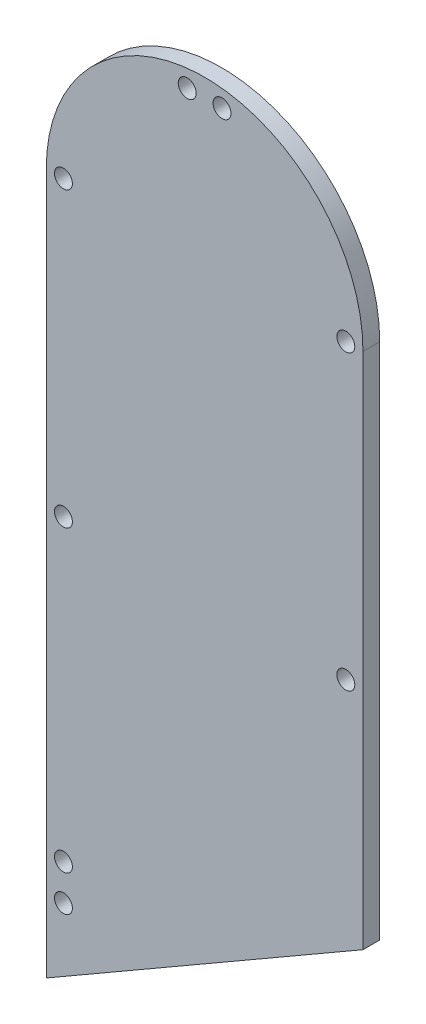
ISO-10303-21;
HEADER;
FILE_DESCRIPTION(('STEP AP214'),'2;1');
FILE_NAME('part.step','',(''),(''),'','','');
FILE_SCHEMA(('AUTOMOTIVE_DESIGN { 1 0 10303 214 1 1 1 1 }'));
ENDSEC;
DATA;
#1=APPLICATION_CONTEXT('core data for automotive mechanical design processes');
#2=APPLICATION_PROTOCOL_DEFINITION('international standard','automotive_design',2000,#1);
#3=PRODUCT_CONTEXT('',#1,'mechanical');
#4=PRODUCT('Part','Part','',(#3));
#5=PRODUCT_RELATED_PRODUCT_CATEGORY('part','',(#4));
#6=PRODUCT_DEFINITION_FORMATION('','',#4);
#7=PRODUCT_DEFINITION_CONTEXT('part definition',#1,'design');
#8=PRODUCT_DEFINITION('design','',#6,#7);
#9=PRODUCT_DEFINITION_SHAPE('','',#8);
#10=(LENGTH_UNIT() NAMED_UNIT(*) SI_UNIT(.MILLI.,.METRE.));
#11=(NAMED_UNIT(*) PLANE_ANGLE_UNIT() SI_UNIT($,.RADIAN.));
#12=(NAMED_UNIT(*) SI_UNIT($,.STERADIAN.) SOLID_ANGLE_UNIT());
#13=UNCERTAINTY_MEASURE_WITH_UNIT(LENGTH_MEASURE(1.E-05),#10,'distance_accuracy_value','');
#14=(GEOMETRIC_REPRESENTATION_CONTEXT(3) GLOBAL_UNCERTAINTY_ASSIGNED_CONTEXT((#13)) GLOBAL_UNIT_ASSIGNED_CONTEXT((#10,
#11,#12)) REPRESENTATION_CONTEXT('',''));
#15=CARTESIAN_POINT('',(0.,0.,0.));
#16=DIRECTION('',(0.,0.,1.));
#17=DIRECTION('',(1.,0.,0.));
#18=AXIS2_PLACEMENT_3D('',#15,#16,#17);
#19=CARTESIAN_POINT('',(24.5827179372451,-59.5829059297929,3.175));
#20=DIRECTION('',(0.,0.,1.));
#21=DIRECTION('',(1.,0.,0.));
#22=AXIS2_PLACEMENT_3D('',#19,#20,#21);
#23=PLANE('',#22);
#24=DIRECTION('',(-0.866025403784438,-0.500000000000001,0.));
#25=VECTOR('',#24,1.);
#26=CARTESIAN_POINT('',(-23.1785985762499,28.3308495887852,3.175));
#27=LINE('',#26,#25);
#28=CARTESIAN_POINT('',(54.5827179372451,73.2263666103914,3.175));
#29=VERTEX_POINT('',#28);
#30=CARTESIAN_POINT('',(-5.41728206275491,38.5853504590137,3.175));
#31=VERTEX_POINT('',#30);
#32=EDGE_CURVE('E47',#29,#31,#27,.T.);
#33=ORIENTED_EDGE('',*,*,#32,.F.);
#34=DIRECTION('',(0.,1.,0.));
#35=VECTOR('',#34,1.);
#36=CARTESIAN_POINT('',(54.5827179372451,-59.5829059297929,3.175));
#37=LINE('',#36,#35);
#38=CARTESIAN_POINT('',(54.5827179372451,171.394622999198,3.175));
#39=VERTEX_POINT('',#38);
#40=EDGE_CURVE('E90',#29,#39,#37,.T.);
#41=ORIENTED_EDGE('',*,*,#40,.T.);
#42=CARTESIAN_POINT('',(24.5827179372451,171.394622999198,3.175));
#43=DIRECTION('',(0.,0.,1.));
#44=DIRECTION('',(1.,0.,0.));
#45=AXIS2_PLACEMENT_3D('',#42,#43,#44);
#46=CIRCLE('',#45,30.);
#47=CARTESIAN_POINT('',(-5.41728206275491,171.394622999198,3.175));
#48=VERTEX_POINT('',#47);
#49=EDGE_CURVE('E55',#39,#48,#46,.T.);
#50=ORIENTED_EDGE('',*,*,#49,.T.);
#51=DIRECTION('',(0.,-1.,0.));
#52=VECTOR('',#51,1.);
#53=CARTESIAN_POINT('',(-5.41728206275491,171.394622999198,3.175));
#54=LINE('',#53,#52);
#55=EDGE_CURVE('E83',#48,#31,#54,.T.);
#56=ORIENTED_EDGE('',*,*,#55,.T.);
#57=EDGE_LOOP('',(#33,#41,#50,#56));
#58=FACE_BOUND('',#57,.T.);
#59=CARTESIAN_POINT('',(21.2827179372451,197.940291195723,3.175));
#60=DIRECTION('',(0.,0.,1.));
#61=DIRECTION('',(1.,0.,0.));
#62=AXIS2_PLACEMENT_3D('',#59,#60,#61);
#63=CIRCLE('',#62,1.70000000000001);
#64=CARTESIAN_POINT('',(22.9827179372451,197.940291195723,3.175));
#65=VERTEX_POINT('',#64);
#66=EDGE_CURVE('E131',#65,#65,#63,.T.);
#67=ORIENTED_EDGE('',*,*,#66,.F.);
#68=EDGE_LOOP('',(#67));
#69=FACE_BOUND('',#68,.T.);
#70=CARTESIAN_POINT('',(51.3327179372449,115.905858534703,3.175));
#71=DIRECTION('',(0.,0.,1.));
#72=DIRECTION('',(1.,0.,0.));
#73=AXIS2_PLACEMENT_3D('',#70,#71,#72);
#74=CIRCLE('',#73,1.70000000000001);
#75=CARTESIAN_POINT('',(53.0327179372449,115.905858534703,3.175));
#76=VERTEX_POINT('',#75);
#77=EDGE_CURVE('E119',#76,#76,#74,.T.);
#78=ORIENTED_EDGE('',*,*,#77,.F.);
#79=EDGE_LOOP('',(#78));
#80=FACE_BOUND('',#79,.T.);
#81=CARTESIAN_POINT('',(51.3327179372474,171.3946229992,3.175));
#82=DIRECTION('',(0.,0.,1.));
#83=DIRECTION('',(1.,0.,0.));
#84=AXIS2_PLACEMENT_3D('',#81,#82,#83);
#85=CIRCLE('',#84,1.70000000000001);
#86=CARTESIAN_POINT('',(53.0327179372474,171.3946229992,3.175));
#87=VERTEX_POINT('',#86);
#88=EDGE_CURVE('E101',#87,#87,#85,.T.);
#89=ORIENTED_EDGE('',*,*,#88,.F.);
#90=EDGE_LOOP('',(#89));
#91=FACE_BOUND('',#90,.T.);
#92=CARTESIAN_POINT('',(27.8827179372451,197.940291195723,3.175));
#93=DIRECTION('',(0.,0.,1.));
#94=DIRECTION('',(1.,0.,0.));
#95=AXIS2_PLACEMENT_3D('',#92,#93,#94);
#96=CIRCLE('',#95,1.70000000000001);
#97=CARTESIAN_POINT('',(29.5827179372451,197.940291195723,3.175));
#98=VERTEX_POINT('',#97);
#99=EDGE_CURVE('E95',#98,#98,#96,.T.);
#100=ORIENTED_EDGE('',*,*,#99,.F.);
#101=EDGE_LOOP('',(#100));
#102=FACE_BOUND('',#101,.T.);
#103=CARTESIAN_POINT('',(-2.1672820627549,59.3058585347025,3.175));
#104=DIRECTION('',(0.,0.,1.));
#105=DIRECTION('',(1.,0.,0.));
#106=AXIS2_PLACEMENT_3D('',#103,#104,#105);
#107=CIRCLE('',#106,1.70000000000001);
#108=CARTESIAN_POINT('',(-0.46728206275489,59.3058585347025,3.175));
#109=VERTEX_POINT('',#108);
#110=EDGE_CURVE('E107',#109,#109,#107,.T.);
#111=ORIENTED_EDGE('',*,*,#110,.F.);
#112=EDGE_LOOP('',(#111));
#113=FACE_BOUND('',#112,.T.);
#114=CARTESIAN_POINT('',(-2.16728206275266,171.394622999196,3.175));
#115=DIRECTION('',(0.,0.,1.));
#116=DIRECTION('',(1.,0.,0.));
#117=AXIS2_PLACEMENT_3D('',#114,#115,#116);
#118=CIRCLE('',#117,1.70000000000001);
#119=CARTESIAN_POINT('',(-0.467282062752642,171.394622999196,3.175));
#120=VERTEX_POINT('',#119);
#121=EDGE_CURVE('E113',#120,#120,#118,.T.);
#122=ORIENTED_EDGE('',*,*,#121,.F.);
#123=EDGE_LOOP('',(#122));
#124=FACE_BOUND('',#123,.T.);
#125=CARTESIAN_POINT('',(-2.16728206275513,115.905858534703,3.175));
#126=DIRECTION('',(0.,0.,1.));
#127=DIRECTION('',(1.,0.,0.));
#128=AXIS2_PLACEMENT_3D('',#125,#126,#127);
#129=CIRCLE('',#128,1.70000000000001);
#130=CARTESIAN_POINT('',(-0.467282062755112,115.905858534703,3.175));
#131=VERTEX_POINT('',#130);
#132=EDGE_CURVE('E125',#131,#131,#129,.T.);
#133=ORIENTED_EDGE('',*,*,#132,.F.);
#134=EDGE_LOOP('',(#133));
#135=FACE_BOUND('',#134,.T.);
#136=CARTESIAN_POINT('',(-2.1672820627549,52.5058585347025,3.175));
#137=DIRECTION('',(0.,0.,1.));
#138=DIRECTION('',(1.,0.,0.));
#139=AXIS2_PLACEMENT_3D('',#136,#137,#138);
#140=CIRCLE('',#139,1.70000000000001);
#141=CARTESIAN_POINT('',(-0.46728206275489,52.5058585347025,3.175));
#142=VERTEX_POINT('',#141);
#143=EDGE_CURVE('E137',#142,#142,#140,.T.);
#144=ORIENTED_EDGE('',*,*,#143,.F.);
#145=EDGE_LOOP('',(#144));
#146=FACE_BOUND('',#145,.T.);
#147=ADVANCED_FACE('F32',(#58,#69,#80,#91,#102,#113,#124,#135,#146),#23,.T.);
#148=CARTESIAN_POINT('',(24.5827179372451,-59.5829059297929,0.));
#149=DIRECTION('',(0.,0.,1.));
#150=DIRECTION('',(1.,0.,0.));
#151=AXIS2_PLACEMENT_3D('',#148,#149,#150);
#152=PLANE('',#151);
#153=DIRECTION('',(0.,1.,0.));
#154=VECTOR('',#153,1.);
#155=CARTESIAN_POINT('',(54.5827179372451,-59.5829059297929,0.));
#156=LINE('',#155,#154);
#157=CARTESIAN_POINT('',(54.5827179372451,73.2263666103914,0.));
#158=VERTEX_POINT('',#157);
#159=CARTESIAN_POINT('',(54.5827179372451,171.394622999198,0.));
#160=VERTEX_POINT('',#159);
#161=EDGE_CURVE('E78',#158,#160,#156,.T.);
#162=ORIENTED_EDGE('',*,*,#161,.F.);
#163=DIRECTION('',(-0.866025403784438,-0.500000000000001,0.));
#164=VECTOR('',#163,1.);
#165=CARTESIAN_POINT('',(-23.1785985762499,28.3308495887852,0.));
#166=LINE('',#165,#164);
#167=CARTESIAN_POINT('',(-5.41728206275491,38.5853504590137,0.));
#168=VERTEX_POINT('',#167);
#169=EDGE_CURVE('E89',#158,#168,#166,.T.);
#170=ORIENTED_EDGE('',*,*,#169,.T.);
#171=DIRECTION('',(0.,-1.,0.));
#172=VECTOR('',#171,1.);
#173=CARTESIAN_POINT('',(-5.41728206275491,171.394622999198,0.));
#174=LINE('',#173,#172);
#175=CARTESIAN_POINT('',(-5.41728206275491,171.394622999198,0.));
#176=VERTEX_POINT('',#175);
#177=EDGE_CURVE('E77',#176,#168,#174,.T.);
#178=ORIENTED_EDGE('',*,*,#177,.F.);
#179=CARTESIAN_POINT('',(24.5827179372451,171.394622999198,0.));
#180=DIRECTION('',(0.,0.,1.));
#181=DIRECTION('',(1.,0.,0.));
#182=AXIS2_PLACEMENT_3D('',#179,#180,#181);
#183=CIRCLE('',#182,30.);
#184=EDGE_CURVE('E68',#160,#176,#183,.T.);
#185=ORIENTED_EDGE('',*,*,#184,.F.);
#186=EDGE_LOOP('',(#162,#170,#178,#185));
#187=FACE_BOUND('',#186,.T.);
#188=CARTESIAN_POINT('',(27.8827179372451,197.940291195723,0.));
#189=DIRECTION('',(0.,0.,1.));
#190=DIRECTION('',(1.,0.,0.));
#191=AXIS2_PLACEMENT_3D('',#188,#189,#190);
#192=CIRCLE('',#191,1.70000000000001);
#193=CARTESIAN_POINT('',(29.5827179372451,197.940291195723,0.));
#194=VERTEX_POINT('',#193);
#195=EDGE_CURVE('E98',#194,#194,#192,.T.);
#196=ORIENTED_EDGE('',*,*,#195,.T.);
#197=EDGE_LOOP('',(#196));
#198=FACE_BOUND('',#197,.T.);
#199=CARTESIAN_POINT('',(51.3327179372474,171.3946229992,0.));
#200=DIRECTION('',(0.,0.,1.));
#201=DIRECTION('',(1.,0.,0.));
#202=AXIS2_PLACEMENT_3D('',#199,#200,#201);
#203=CIRCLE('',#202,1.70000000000001);
#204=CARTESIAN_POINT('',(53.0327179372474,171.3946229992,0.));
#205=VERTEX_POINT('',#204);
#206=EDGE_CURVE('E104',#205,#205,#203,.T.);
#207=ORIENTED_EDGE('',*,*,#206,.T.);
#208=EDGE_LOOP('',(#207));
#209=FACE_BOUND('',#208,.T.);
#210=CARTESIAN_POINT('',(-2.1672820627549,59.3058585347025,0.));
#211=DIRECTION('',(0.,0.,1.));
#212=DIRECTION('',(1.,0.,0.));
#213=AXIS2_PLACEMENT_3D('',#210,#211,#212);
#214=CIRCLE('',#213,1.70000000000001);
#215=CARTESIAN_POINT('',(-0.46728206275489,59.3058585347025,0.));
#216=VERTEX_POINT('',#215);
#217=EDGE_CURVE('E110',#216,#216,#214,.T.);
#218=ORIENTED_EDGE('',*,*,#217,.T.);
#219=EDGE_LOOP('',(#218));
#220=FACE_BOUND('',#219,.T.);
#221=CARTESIAN_POINT('',(-2.16728206275266,171.394622999196,0.));
#222=DIRECTION('',(0.,0.,1.));
#223=DIRECTION('',(1.,0.,0.));
#224=AXIS2_PLACEMENT_3D('',#221,#222,#223);
#225=CIRCLE('',#224,1.70000000000001);
#226=CARTESIAN_POINT('',(-0.467282062752642,171.394622999196,0.));
#227=VERTEX_POINT('',#226);
#228=EDGE_CURVE('E116',#227,#227,#225,.T.);
#229=ORIENTED_EDGE('',*,*,#228,.T.);
#230=EDGE_LOOP('',(#229));
#231=FACE_BOUND('',#230,.T.);
#232=CARTESIAN_POINT('',(51.3327179372449,115.905858534703,0.));
#233=DIRECTION('',(0.,0.,1.));
#234=DIRECTION('',(1.,0.,0.));
#235=AXIS2_PLACEMENT_3D('',#232,#233,#234);
#236=CIRCLE('',#235,1.70000000000001);
#237=CARTESIAN_POINT('',(53.0327179372449,115.905858534703,0.));
#238=VERTEX_POINT('',#237);
#239=EDGE_CURVE('E122',#238,#238,#236,.T.);
#240=ORIENTED_EDGE('',*,*,#239,.T.);
#241=EDGE_LOOP('',(#240));
#242=FACE_BOUND('',#241,.T.);
#243=CARTESIAN_POINT('',(-2.16728206275513,115.905858534703,0.));
#244=DIRECTION('',(0.,0.,1.));
#245=DIRECTION('',(1.,0.,0.));
#246=AXIS2_PLACEMENT_3D('',#243,#244,#245);
#247=CIRCLE('',#246,1.70000000000001);
#248=CARTESIAN_POINT('',(-0.467282062755112,115.905858534703,0.));
#249=VERTEX_POINT('',#248);
#250=EDGE_CURVE('E128',#249,#249,#247,.T.);
#251=ORIENTED_EDGE('',*,*,#250,.T.);
#252=EDGE_LOOP('',(#251));
#253=FACE_BOUND('',#252,.T.);
#254=CARTESIAN_POINT('',(21.2827179372451,197.940291195723,0.));
#255=DIRECTION('',(0.,0.,1.));
#256=DIRECTION('',(1.,0.,0.));
#257=AXIS2_PLACEMENT_3D('',#254,#255,#256);
#258=CIRCLE('',#257,1.70000000000001);
#259=CARTESIAN_POINT('',(22.9827179372451,197.940291195723,0.));
#260=VERTEX_POINT('',#259);
#261=EDGE_CURVE('E134',#260,#260,#258,.T.);
#262=ORIENTED_EDGE('',*,*,#261,.T.);
#263=EDGE_LOOP('',(#262));
#264=FACE_BOUND('',#263,.T.);
#265=CARTESIAN_POINT('',(-2.1672820627549,52.5058585347025,0.));
#266=DIRECTION('',(0.,0.,1.));
#267=DIRECTION('',(1.,0.,0.));
#268=AXIS2_PLACEMENT_3D('',#265,#266,#267);
#269=CIRCLE('',#268,1.70000000000001);
#270=CARTESIAN_POINT('',(-0.46728206275489,52.5058585347025,0.));
#271=VERTEX_POINT('',#270);
#272=EDGE_CURVE('E140',#271,#271,#269,.T.);
#273=ORIENTED_EDGE('',*,*,#272,.T.);
#274=EDGE_LOOP('',(#273));
#275=FACE_BOUND('',#274,.T.);
#276=ADVANCED_FACE('F86',(#187,#198,#209,#220,#231,#242,#253,#264,#275),#152,.F.);
#277=CARTESIAN_POINT('',(54.5827179372451,-59.5829059297929,3.175));
#278=DIRECTION('',(-1.,0.,0.));
#279=DIRECTION('',(0.,0.,1.));
#280=AXIS2_PLACEMENT_3D('',#277,#278,#279);
#281=PLANE('',#280);
#282=ORIENTED_EDGE('',*,*,#40,.F.);
#283=DIRECTION('',(0.,0.,-1.));
#284=VECTOR('',#283,1.);
#285=CARTESIAN_POINT('',(54.5827179372451,73.2263666103914,3.175));
#286=LINE('',#285,#284);
#287=EDGE_CURVE('E143',#29,#158,#286,.T.);
#288=ORIENTED_EDGE('',*,*,#287,.T.);
#289=ORIENTED_EDGE('',*,*,#161,.T.);
#290=DIRECTION('',(0.,0.,-1.));
#291=VECTOR('',#290,1.);
#292=CARTESIAN_POINT('',(54.5827179372451,171.394622999198,3.175));
#293=LINE('',#292,#291);
#294=EDGE_CURVE('E40',#39,#160,#293,.T.);
#295=ORIENTED_EDGE('',*,*,#294,.F.);
#296=EDGE_LOOP('',(#282,#288,#289,#295));
#297=FACE_BOUND('',#296,.T.);
#298=ADVANCED_FACE('F34',(#297),#281,.F.);
#299=CARTESIAN_POINT('',(24.5827179372451,171.394622999198,3.175));
#300=DIRECTION('',(0.,0.,-1.));
#301=DIRECTION('',(-1.,0.,0.));
#302=AXIS2_PLACEMENT_3D('',#299,#300,#301);
#303=CYLINDRICAL_SURFACE('',#302,30.);
#304=ORIENTED_EDGE('',*,*,#184,.T.);
#305=DIRECTION('',(0.,0.,-1.));
#306=VECTOR('',#305,1.);
#307=CARTESIAN_POINT('',(-5.41728206275491,171.394622999198,3.175));
#308=LINE('',#307,#306);
#309=EDGE_CURVE('E71',#48,#176,#308,.T.);
#310=ORIENTED_EDGE('',*,*,#309,.F.);
#311=ORIENTED_EDGE('',*,*,#49,.F.);
#312=ORIENTED_EDGE('',*,*,#294,.T.);
#313=EDGE_LOOP('',(#304,#310,#311,#312));
#314=FACE_BOUND('',#313,.T.);
#315=ADVANCED_FACE('F70',(#314),#303,.T.);
#316=CARTESIAN_POINT('',(-5.41728206275491,171.394622999198,3.175));
#317=DIRECTION('',(1.,0.,0.));
#318=DIRECTION('',(0.,0.,-1.));
#319=AXIS2_PLACEMENT_3D('',#316,#317,#318);
#320=PLANE('',#319);
#321=ORIENTED_EDGE('',*,*,#177,.T.);
#322=DIRECTION('',(0.,0.,1.));
#323=VECTOR('',#322,1.);
#324=CARTESIAN_POINT('',(-5.41728206275491,38.5853504590137,3.175));
#325=LINE('',#324,#323);
#326=EDGE_CURVE('E11',#168,#31,#325,.T.);
#327=ORIENTED_EDGE('',*,*,#326,.T.);
#328=ORIENTED_EDGE('',*,*,#55,.F.);
#329=ORIENTED_EDGE('',*,*,#309,.T.);
#330=EDGE_LOOP('',(#321,#327,#328,#329));
#331=FACE_BOUND('',#330,.T.);
#332=ADVANCED_FACE('F82',(#331),#320,.F.);
#333=CARTESIAN_POINT('',(27.8827179372451,197.940291195723,3.175));
#334=DIRECTION('',(0.,0.,-1.));
#335=DIRECTION('',(-1.,0.,0.));
#336=AXIS2_PLACEMENT_3D('',#333,#334,#335);
#337=CYLINDRICAL_SURFACE('',#336,1.70000000000001);
#338=ORIENTED_EDGE('',*,*,#99,.T.);
#339=EDGE_LOOP('',(#338));
#340=FACE_BOUND('',#339,.T.);
#341=ORIENTED_EDGE('',*,*,#195,.F.);
#342=EDGE_LOOP('',(#341));
#343=FACE_BOUND('',#342,.T.);
#344=ADVANCED_FACE('F190',(#340,#343),#337,.F.);
#345=CARTESIAN_POINT('',(51.3327179372474,171.3946229992,3.175));
#346=DIRECTION('',(0.,0.,-1.));
#347=DIRECTION('',(-1.,0.,0.));
#348=AXIS2_PLACEMENT_3D('',#345,#346,#347);
#349=CYLINDRICAL_SURFACE('',#348,1.70000000000001);
#350=ORIENTED_EDGE('',*,*,#88,.T.);
#351=EDGE_LOOP('',(#350));
#352=FACE_BOUND('',#351,.T.);
#353=ORIENTED_EDGE('',*,*,#206,.F.);
#354=EDGE_LOOP('',(#353));
#355=FACE_BOUND('',#354,.T.);
#356=ADVANCED_FACE('F207',(#352,#355),#349,.F.);
#357=CARTESIAN_POINT('',(-2.1672820627549,59.3058585347025,3.175));
#358=DIRECTION('',(0.,0.,-1.));
#359=DIRECTION('',(-1.,0.,0.));
#360=AXIS2_PLACEMENT_3D('',#357,#358,#359);
#361=CYLINDRICAL_SURFACE('',#360,1.70000000000001);
#362=ORIENTED_EDGE('',*,*,#110,.T.);
#363=EDGE_LOOP('',(#362));
#364=FACE_BOUND('',#363,.T.);
#365=ORIENTED_EDGE('',*,*,#217,.F.);
#366=EDGE_LOOP('',(#365));
#367=FACE_BOUND('',#366,.T.);
#368=ADVANCED_FACE('F214',(#364,#367),#361,.F.);
#369=CARTESIAN_POINT('',(-2.16728206275266,171.394622999196,3.175));
#370=DIRECTION('',(0.,0.,-1.));
#371=DIRECTION('',(-1.,0.,0.));
#372=AXIS2_PLACEMENT_3D('',#369,#370,#371);
#373=CYLINDRICAL_SURFACE('',#372,1.70000000000001);
#374=ORIENTED_EDGE('',*,*,#121,.T.);
#375=EDGE_LOOP('',(#374));
#376=FACE_BOUND('',#375,.T.);
#377=ORIENTED_EDGE('',*,*,#228,.F.);
#378=EDGE_LOOP('',(#377));
#379=FACE_BOUND('',#378,.T.);
#380=ADVANCED_FACE('F222',(#376,#379),#373,.F.);
#381=CARTESIAN_POINT('',(51.3327179372449,115.905858534703,3.175));
#382=DIRECTION('',(0.,0.,-1.));
#383=DIRECTION('',(-1.,0.,0.));
#384=AXIS2_PLACEMENT_3D('',#381,#382,#383);
#385=CYLINDRICAL_SURFACE('',#384,1.70000000000001);
#386=ORIENTED_EDGE('',*,*,#77,.T.);
#387=EDGE_LOOP('',(#386));
#388=FACE_BOUND('',#387,.T.);
#389=ORIENTED_EDGE('',*,*,#239,.F.);
#390=EDGE_LOOP('',(#389));
#391=FACE_BOUND('',#390,.T.);
#392=ADVANCED_FACE('F230',(#388,#391),#385,.F.);
#393=CARTESIAN_POINT('',(-2.16728206275513,115.905858534703,3.175));
#394=DIRECTION('',(0.,0.,-1.));
#395=DIRECTION('',(-1.,0.,0.));
#396=AXIS2_PLACEMENT_3D('',#393,#394,#395);
#397=CYLINDRICAL_SURFACE('',#396,1.70000000000001);
#398=ORIENTED_EDGE('',*,*,#132,.T.);
#399=EDGE_LOOP('',(#398));
#400=FACE_BOUND('',#399,.T.);
#401=ORIENTED_EDGE('',*,*,#250,.F.);
#402=EDGE_LOOP('',(#401));
#403=FACE_BOUND('',#402,.T.);
#404=ADVANCED_FACE('F238',(#400,#403),#397,.F.);
#405=CARTESIAN_POINT('',(21.2827179372451,197.940291195723,3.175));
#406=DIRECTION('',(0.,0.,-1.));
#407=DIRECTION('',(-1.,0.,0.));
#408=AXIS2_PLACEMENT_3D('',#405,#406,#407);
#409=CYLINDRICAL_SURFACE('',#408,1.70000000000001);
#410=ORIENTED_EDGE('',*,*,#66,.T.);
#411=EDGE_LOOP('',(#410));
#412=FACE_BOUND('',#411,.T.);
#413=ORIENTED_EDGE('',*,*,#261,.F.);
#414=EDGE_LOOP('',(#413));
#415=FACE_BOUND('',#414,.T.);
#416=ADVANCED_FACE('F178',(#412,#415),#409,.F.);
#417=CARTESIAN_POINT('',(-2.1672820627549,52.5058585347025,3.175));
#418=DIRECTION('',(0.,0.,-1.));
#419=DIRECTION('',(-1.,0.,0.));
#420=AXIS2_PLACEMENT_3D('',#417,#418,#419);
#421=CYLINDRICAL_SURFACE('',#420,1.70000000000001);
#422=ORIENTED_EDGE('',*,*,#143,.T.);
#423=EDGE_LOOP('',(#422));
#424=FACE_BOUND('',#423,.T.);
#425=ORIENTED_EDGE('',*,*,#272,.F.);
#426=EDGE_LOOP('',(#425));
#427=FACE_BOUND('',#426,.T.);
#428=ADVANCED_FACE('F175',(#424,#427),#421,.F.);
#429=CARTESIAN_POINT('',(-23.1785985762499,28.3308495887852,0.));
#430=DIRECTION('',(-0.500000000000001,0.866025403784438,0.));
#431=DIRECTION('',(-0.866025403784438,-0.500000000000002,0.));
#432=AXIS2_PLACEMENT_3D('',#429,#430,#431);
#433=PLANE('',#432);
#434=ORIENTED_EDGE('',*,*,#32,.T.);
#435=ORIENTED_EDGE('',*,*,#326,.F.);
#436=ORIENTED_EDGE('',*,*,#169,.F.);
#437=ORIENTED_EDGE('',*,*,#287,.F.);
#438=EDGE_LOOP('',(#434,#435,#436,#437));
#439=FACE_BOUND('',#438,.T.);
#440=ADVANCED_FACE('F154',(#439),#433,.F.);
#441=CLOSED_SHELL('',(#147,#276,#298,#315,#332,#344,#356,#368,#380,#392,#404,#416,#428,#440));
#442=MANIFOLD_SOLID_BREP('B2',#441);
#443=ADVANCED_BREP_SHAPE_REPRESENTATION('',(#18,#442),#14);
#444=SHAPE_DEFINITION_REPRESENTATION(#9,#443);
ENDSEC;
END-ISO-10303-21;
